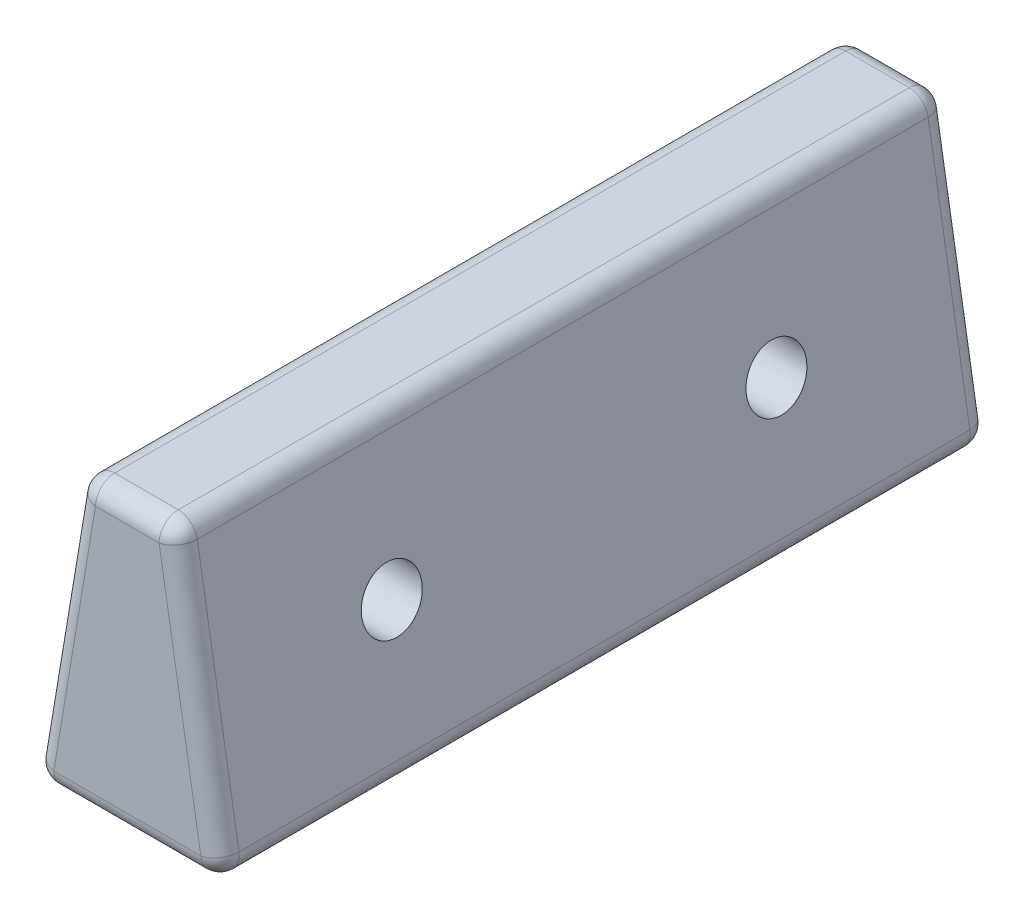
ISO-10303-21;
HEADER;
FILE_DESCRIPTION(('STEP AP214'),'2;1');
FILE_NAME('part.step','',(''),(''),'','','');
FILE_SCHEMA(('AUTOMOTIVE_DESIGN { 1 0 10303 214 1 1 1 1 }'));
ENDSEC;
DATA;
#1=APPLICATION_CONTEXT('core data for automotive mechanical design processes');
#2=APPLICATION_PROTOCOL_DEFINITION('international standard','automotive_design',2000,#1);
#3=PRODUCT_CONTEXT('',#1,'mechanical');
#4=PRODUCT('Part','Part','',(#3));
#5=PRODUCT_RELATED_PRODUCT_CATEGORY('part','',(#4));
#6=PRODUCT_DEFINITION_FORMATION('','',#4);
#7=PRODUCT_DEFINITION_CONTEXT('part definition',#1,'design');
#8=PRODUCT_DEFINITION('design','',#6,#7);
#9=PRODUCT_DEFINITION_SHAPE('','',#8);
#10=(LENGTH_UNIT() NAMED_UNIT(*) SI_UNIT(.MILLI.,.METRE.));
#11=(NAMED_UNIT(*) PLANE_ANGLE_UNIT() SI_UNIT($,.RADIAN.));
#12=(NAMED_UNIT(*) SI_UNIT($,.STERADIAN.) SOLID_ANGLE_UNIT());
#13=UNCERTAINTY_MEASURE_WITH_UNIT(LENGTH_MEASURE(1.E-05),#10,'distance_accuracy_value','');
#14=(GEOMETRIC_REPRESENTATION_CONTEXT(3) GLOBAL_UNCERTAINTY_ASSIGNED_CONTEXT((#13)) GLOBAL_UNIT_ASSIGNED_CONTEXT((#10,
#11,#12)) REPRESENTATION_CONTEXT('',''));
#15=CARTESIAN_POINT('',(0.,0.,0.));
#16=DIRECTION('',(0.,0.,1.));
#17=DIRECTION('',(1.,0.,0.));
#18=AXIS2_PLACEMENT_3D('',#15,#16,#17);
#19=CARTESIAN_POINT('',(6.34999999999986,38.1,50.8));
#20=DIRECTION('',(0.,-1.,0.));
#21=DIRECTION('',(1.,0.,0.));
#22=AXIS2_PLACEMENT_3D('',#19,#20,#21);
#23=PLANE('',#22);
#24=DIRECTION('',(-1.,0.,0.));
#25=VECTOR('',#24,1.);
#26=CARTESIAN_POINT('',(6.34999999999986,38.1,-48.26));
#27=LINE('',#26,#25);
#28=CARTESIAN_POINT('',(4.19829719550695,38.1,-48.26));
#29=VERTEX_POINT('',#28);
#30=CARTESIAN_POINT('',(-4.19829719550722,38.1,-48.26));
#31=VERTEX_POINT('',#30);
#32=EDGE_CURVE('E42',#29,#31,#27,.T.);
#33=ORIENTED_EDGE('',*,*,#32,.T.);
#34=DIRECTION('',(0.,0.,-1.));
#35=VECTOR('',#34,1.);
#36=CARTESIAN_POINT('',(-4.19829719550722,38.1,50.8));
#37=LINE('',#36,#35);
#38=CARTESIAN_POINT('',(-4.19829719550722,38.1,48.26));
#39=VERTEX_POINT('',#38);
#40=EDGE_CURVE('E11',#31,#39,#37,.F.);
#41=ORIENTED_EDGE('',*,*,#40,.T.);
#42=DIRECTION('',(-1.,0.,0.));
#43=VECTOR('',#42,1.);
#44=CARTESIAN_POINT('',(6.34999999999986,38.1,48.26));
#45=LINE('',#44,#43);
#46=CARTESIAN_POINT('',(4.19829719550695,38.1,48.26));
#47=VERTEX_POINT('',#46);
#48=EDGE_CURVE('E205',#39,#47,#45,.F.);
#49=ORIENTED_EDGE('',*,*,#48,.T.);
#50=DIRECTION('',(0.,0.,-1.));
#51=VECTOR('',#50,1.);
#52=CARTESIAN_POINT('',(4.19829719550695,38.1,50.8));
#53=LINE('',#52,#51);
#54=EDGE_CURVE('E203',#47,#29,#53,.T.);
#55=ORIENTED_EDGE('',*,*,#54,.T.);
#56=EDGE_LOOP('',(#33,#41,#49,#55));
#57=FACE_BOUND('',#56,.T.);
#58=ADVANCED_FACE('F33',(#57),#23,.F.);
#59=CARTESIAN_POINT('',(-6.35000000000014,38.1,50.8));
#60=DIRECTION('',(0.986393923832144,-0.164398987305354,0.));
#61=DIRECTION('',(0.164398987305354,0.986393923832144,0.));
#62=AXIS2_PLACEMENT_3D('',#59,#60,#61);
#63=PLANE('',#62);
#64=CARTESIAN_POINT('',(-9.52500000000007,19.05,25.4));
#65=DIRECTION('',(0.986393923832144,-0.164398987305354,0.));
#66=DIRECTION('',(0.164398987305354,0.986393923832144,0.));
#67=AXIS2_PLACEMENT_3D('',#64,#65,#66);
#68=ELLIPSE('',#67,4.0234939653535,3.96875);
#69=CARTESIAN_POINT('',(-8.86354166666675,23.01875,25.4));
#70=VERTEX_POINT('',#69);
#71=EDGE_CURVE('E162',#70,#70,#68,.T.);
#72=ORIENTED_EDGE('',*,*,#71,.T.);
#73=EDGE_LOOP('',(#72));
#74=FACE_BOUND('',#73,.T.);
#75=CARTESIAN_POINT('',(-9.52500000000007,19.05,-25.4));
#76=DIRECTION('',(0.986393923832144,-0.164398987305354,0.));
#77=DIRECTION('',(0.164398987305354,0.986393923832144,0.));
#78=AXIS2_PLACEMENT_3D('',#75,#76,#77);
#79=ELLIPSE('',#78,4.02349396535351,3.96875);
#80=CARTESIAN_POINT('',(-8.86354166666675,23.01875,-25.4));
#81=VERTEX_POINT('',#80);
#82=EDGE_CURVE('E257',#81,#81,#79,.T.);
#83=ORIENTED_EDGE('',*,*,#82,.T.);
#84=EDGE_LOOP('',(#83));
#85=FACE_BOUND('',#84,.T.);
#86=DIRECTION('',(0.,0.,-1.));
#87=VECTOR('',#86,1.);
#88=CARTESIAN_POINT('',(-6.70373776204087,35.9775734277556,50.8));
#89=LINE('',#88,#87);
#90=CARTESIAN_POINT('',(-6.70373776204087,35.9775734277556,48.26));
#91=VERTEX_POINT('',#90);
#92=CARTESIAN_POINT('',(-6.70373776204087,35.9775734277556,-48.26));
#93=VERTEX_POINT('',#92);
#94=EDGE_CURVE('E129',#91,#93,#89,.T.);
#95=ORIENTED_EDGE('',*,*,#94,.T.);
#96=DIRECTION('',(-0.164398987305354,-0.986393923832144,0.));
#97=VECTOR('',#96,1.);
#98=CARTESIAN_POINT('',(-6.35000000000014,38.1,-48.26));
#99=LINE('',#98,#97);
#100=CARTESIAN_POINT('',(-12.2070710953741,2.9575734277556,-48.26));
#101=VERTEX_POINT('',#100);
#102=EDGE_CURVE('E166',#93,#101,#99,.T.);
#103=ORIENTED_EDGE('',*,*,#102,.T.);
#104=DIRECTION('',(0.,0.,-1.));
#105=VECTOR('',#104,1.);
#106=CARTESIAN_POINT('',(-12.2070710953741,2.9575734277556,50.8));
#107=LINE('',#106,#105);
#108=CARTESIAN_POINT('',(-12.2070710953741,2.9575734277556,48.26));
#109=VERTEX_POINT('',#108);
#110=EDGE_CURVE('E131',#101,#109,#107,.F.);
#111=ORIENTED_EDGE('',*,*,#110,.T.);
#112=DIRECTION('',(-0.164398987305354,-0.986393923832144,0.));
#113=VECTOR('',#112,1.);
#114=CARTESIAN_POINT('',(-6.35000000000014,38.1,48.26));
#115=LINE('',#114,#113);
#116=EDGE_CURVE('E124',#109,#91,#115,.F.);
#117=ORIENTED_EDGE('',*,*,#116,.T.);
#118=EDGE_LOOP('',(#95,#103,#111,#117));
#119=FACE_BOUND('',#118,.T.);
#120=ADVANCED_FACE('F126',(#74,#85,#119),#63,.F.);
#121=CARTESIAN_POINT('',(-12.7,0.,50.8));
#122=DIRECTION('',(0.,1.,0.));
#123=DIRECTION('',(-1.,0.,0.));
#124=AXIS2_PLACEMENT_3D('',#121,#122,#123);
#125=PLANE('',#124);
#126=DIRECTION('',(0.,0.,-1.));
#127=VECTOR('',#126,1.);
#128=CARTESIAN_POINT('',(-9.70163052884043,0.,50.8));
#129=LINE('',#128,#127);
#130=CARTESIAN_POINT('',(-9.70163052884043,0.,48.26));
#131=VERTEX_POINT('',#130);
#132=CARTESIAN_POINT('',(-9.70163052884043,0.,-48.26));
#133=VERTEX_POINT('',#132);
#134=EDGE_CURVE('E181',#131,#133,#129,.T.);
#135=ORIENTED_EDGE('',*,*,#134,.T.);
#136=DIRECTION('',(1.,0.,0.));
#137=VECTOR('',#136,1.);
#138=CARTESIAN_POINT('',(-12.7,0.,-48.26));
#139=LINE('',#138,#137);
#140=CARTESIAN_POINT('',(9.70163052884041,0.,-48.26));
#141=VERTEX_POINT('',#140);
#142=EDGE_CURVE('E183',#133,#141,#139,.T.);
#143=ORIENTED_EDGE('',*,*,#142,.T.);
#144=DIRECTION('',(0.,0.,-1.));
#145=VECTOR('',#144,1.);
#146=CARTESIAN_POINT('',(9.70163052884041,0.,50.8));
#147=LINE('',#146,#145);
#148=CARTESIAN_POINT('',(9.70163052884041,0.,48.26));
#149=VERTEX_POINT('',#148);
#150=EDGE_CURVE('E177',#141,#149,#147,.F.);
#151=ORIENTED_EDGE('',*,*,#150,.T.);
#152=DIRECTION('',(1.,0.,0.));
#153=VECTOR('',#152,1.);
#154=CARTESIAN_POINT('',(-12.7,0.,48.26));
#155=LINE('',#154,#153);
#156=EDGE_CURVE('E179',#149,#131,#155,.F.);
#157=ORIENTED_EDGE('',*,*,#156,.T.);
#158=EDGE_LOOP('',(#135,#143,#151,#157));
#159=FACE_BOUND('',#158,.T.);
#160=ADVANCED_FACE('F286',(#159),#125,.F.);
#161=CARTESIAN_POINT('',(12.7,0.,50.8));
#162=DIRECTION('',(-0.986393923832143,-0.164398987305361,0.));
#163=DIRECTION('',(0.164398987305361,-0.986393923832143,0.));
#164=AXIS2_PLACEMENT_3D('',#161,#162,#163);
#165=PLANE('',#164);
#166=CARTESIAN_POINT('',(9.52499999999993,19.05,25.4));
#167=DIRECTION('',(-0.986393923832143,-0.164398987305361,0.));
#168=DIRECTION('',(0.164398987305361,-0.986393923832143,0.));
#169=AXIS2_PLACEMENT_3D('',#166,#167,#168);
#170=ELLIPSE('',#169,4.02349396535351,3.96875);
#171=CARTESIAN_POINT('',(10.1864583333333,15.08125,25.4));
#172=VERTEX_POINT('',#171);
#173=EDGE_CURVE('E37',#172,#172,#170,.T.);
#174=ORIENTED_EDGE('',*,*,#173,.T.);
#175=EDGE_LOOP('',(#174));
#176=FACE_BOUND('',#175,.T.);
#177=CARTESIAN_POINT('',(9.52499999999993,19.05,-25.4));
#178=DIRECTION('',(-0.986393923832143,-0.164398987305361,0.));
#179=DIRECTION('',(0.164398987305361,-0.986393923832143,0.));
#180=AXIS2_PLACEMENT_3D('',#177,#178,#179);
#181=ELLIPSE('',#180,4.02349396535351,3.96875);
#182=CARTESIAN_POINT('',(10.1864583333333,15.08125,-25.4));
#183=VERTEX_POINT('',#182);
#184=EDGE_CURVE('E255',#183,#183,#181,.T.);
#185=ORIENTED_EDGE('',*,*,#184,.T.);
#186=EDGE_LOOP('',(#185));
#187=FACE_BOUND('',#186,.T.);
#188=DIRECTION('',(0.,0.,-1.));
#189=VECTOR('',#188,1.);
#190=CARTESIAN_POINT('',(12.2070710953741,2.95757342775562,50.8));
#191=LINE('',#190,#189);
#192=CARTESIAN_POINT('',(12.2070710953741,2.95757342775562,48.26));
#193=VERTEX_POINT('',#192);
#194=CARTESIAN_POINT('',(12.2070710953741,2.95757342775562,-48.26));
#195=VERTEX_POINT('',#194);
#196=EDGE_CURVE('E198',#193,#195,#191,.T.);
#197=ORIENTED_EDGE('',*,*,#196,.T.);
#198=DIRECTION('',(-0.164398987305361,0.986393923832143,0.));
#199=VECTOR('',#198,1.);
#200=CARTESIAN_POINT('',(12.7,0.,-48.26));
#201=LINE('',#200,#199);
#202=CARTESIAN_POINT('',(6.7037377620406,35.9775734277556,-48.26));
#203=VERTEX_POINT('',#202);
#204=EDGE_CURVE('E200',#195,#203,#201,.T.);
#205=ORIENTED_EDGE('',*,*,#204,.T.);
#206=DIRECTION('',(0.,0.,-1.));
#207=VECTOR('',#206,1.);
#208=CARTESIAN_POINT('',(6.7037377620406,35.9775734277556,50.8));
#209=LINE('',#208,#207);
#210=CARTESIAN_POINT('',(6.7037377620406,35.9775734277556,48.26));
#211=VERTEX_POINT('',#210);
#212=EDGE_CURVE('E194',#203,#211,#209,.F.);
#213=ORIENTED_EDGE('',*,*,#212,.T.);
#214=DIRECTION('',(-0.164398987305361,0.986393923832143,0.));
#215=VECTOR('',#214,1.);
#216=CARTESIAN_POINT('',(12.7,0.,48.26));
#217=LINE('',#216,#215);
#218=EDGE_CURVE('E196',#211,#193,#217,.F.);
#219=ORIENTED_EDGE('',*,*,#218,.T.);
#220=EDGE_LOOP('',(#197,#205,#213,#219));
#221=FACE_BOUND('',#220,.T.);
#222=ADVANCED_FACE('F374',(#176,#187,#221),#165,.F.);
#223=CARTESIAN_POINT('',(0.,0.,50.8));
#224=DIRECTION('',(0.,0.,1.));
#225=DIRECTION('',(1.,0.,0.));
#226=AXIS2_PLACEMENT_3D('',#223,#224,#225);
#227=PLANE('',#226);
#228=DIRECTION('',(-1.,0.,0.));
#229=VECTOR('',#228,1.);
#230=CARTESIAN_POINT('',(-6.35000000000014,35.56,50.8));
#231=LINE('',#230,#229);
#232=CARTESIAN_POINT('',(4.19829719550695,35.56,50.8));
#233=VERTEX_POINT('',#232);
#234=CARTESIAN_POINT('',(-4.19829719550722,35.56,50.8));
#235=VERTEX_POINT('',#234);
#236=EDGE_CURVE('E188',#233,#235,#231,.T.);
#237=ORIENTED_EDGE('',*,*,#236,.T.);
#238=DIRECTION('',(-0.164398987305354,-0.986393923832144,0.));
#239=VECTOR('',#238,1.);
#240=CARTESIAN_POINT('',(-10.1945594334664,-0.417573427755599,50.8));
#241=LINE('',#240,#239);
#242=CARTESIAN_POINT('',(-9.70163052884043,2.54,50.8));
#243=VERTEX_POINT('',#242);
#244=EDGE_CURVE('E141',#235,#243,#241,.T.);
#245=ORIENTED_EDGE('',*,*,#244,.T.);
#246=DIRECTION('',(1.,0.,0.));
#247=VECTOR('',#246,1.);
#248=CARTESIAN_POINT('',(12.7,2.54,50.8));
#249=LINE('',#248,#247);
#250=CARTESIAN_POINT('',(9.70163052884041,2.54,50.8));
#251=VERTEX_POINT('',#250);
#252=EDGE_CURVE('E190',#243,#251,#249,.T.);
#253=ORIENTED_EDGE('',*,*,#252,.T.);
#254=DIRECTION('',(-0.164398987305361,0.986393923832143,0.));
#255=VECTOR('',#254,1.);
#256=CARTESIAN_POINT('',(3.84455943346621,37.6824265722444,50.8));
#257=LINE('',#256,#255);
#258=EDGE_CURVE('E186',#251,#233,#257,.T.);
#259=ORIENTED_EDGE('',*,*,#258,.T.);
#260=EDGE_LOOP('',(#237,#245,#253,#259));
#261=FACE_BOUND('',#260,.T.);
#262=ADVANCED_FACE('F367',(#261),#227,.T.);
#263=CARTESIAN_POINT('',(0.,0.,-50.8));
#264=DIRECTION('',(0.,0.,1.));
#265=DIRECTION('',(1.,0.,0.));
#266=AXIS2_PLACEMENT_3D('',#263,#264,#265);
#267=PLANE('',#266);
#268=DIRECTION('',(1.,0.,0.));
#269=VECTOR('',#268,1.);
#270=CARTESIAN_POINT('',(0.,2.54,-50.8));
#271=LINE('',#270,#269);
#272=CARTESIAN_POINT('',(9.70163052884041,2.54,-50.8));
#273=VERTEX_POINT('',#272);
#274=CARTESIAN_POINT('',(-9.70163052884043,2.54,-50.8));
#275=VERTEX_POINT('',#274);
#276=EDGE_CURVE('E172',#273,#275,#271,.F.);
#277=ORIENTED_EDGE('',*,*,#276,.T.);
#278=DIRECTION('',(-0.164398987305354,-0.986393923832144,0.));
#279=VECTOR('',#278,1.);
#280=CARTESIAN_POINT('',(-9.85131619022312,1.64188603170382,-50.8));
#281=LINE('',#280,#279);
#282=CARTESIAN_POINT('',(-4.19829719550722,35.56,-50.8));
#283=VERTEX_POINT('',#282);
#284=EDGE_CURVE('E174',#275,#283,#281,.F.);
#285=ORIENTED_EDGE('',*,*,#284,.T.);
#286=DIRECTION('',(-1.,0.,0.));
#287=VECTOR('',#286,1.);
#288=CARTESIAN_POINT('',(0.,35.56,-50.8));
#289=LINE('',#288,#287);
#290=CARTESIAN_POINT('',(4.19829719550695,35.56,-50.8));
#291=VERTEX_POINT('',#290);
#292=EDGE_CURVE('E168',#283,#291,#289,.F.);
#293=ORIENTED_EDGE('',*,*,#292,.T.);
#294=DIRECTION('',(-0.164398987305361,0.986393923832143,0.));
#295=VECTOR('',#294,1.);
#296=CARTESIAN_POINT('',(9.8513161902231,1.64188603170389,-50.8));
#297=LINE('',#296,#295);
#298=EDGE_CURVE('E170',#291,#273,#297,.F.);
#299=ORIENTED_EDGE('',*,*,#298,.T.);
#300=EDGE_LOOP('',(#277,#285,#293,#299));
#301=FACE_BOUND('',#300,.T.);
#302=ADVANCED_FACE('F359',(#301),#267,.F.);
#303=CARTESIAN_POINT('',(9.8513161902231,1.64188603170389,48.26));
#304=DIRECTION('',(0.164398987305361,-0.986393923832143,0.));
#305=DIRECTION('',(0.986393923832143,0.164398987305361,0.));
#306=AXIS2_PLACEMENT_3D('',#303,#304,#305);
#307=CYLINDRICAL_SURFACE('',#306,2.54);
#308=CARTESIAN_POINT('',(4.19829719550695,35.56,48.26));
#309=DIRECTION('',(-0.164398987305362,0.986393923832143,0.));
#310=DIRECTION('',(-0.986393923832143,-0.164398987305362,0.));
#311=AXIS2_PLACEMENT_3D('',#308,#309,#310);
#312=CIRCLE('',#311,2.54);
#313=EDGE_CURVE('E156',#233,#211,#312,.T.);
#314=ORIENTED_EDGE('',*,*,#313,.F.);
#315=ORIENTED_EDGE('',*,*,#258,.F.);
#316=CARTESIAN_POINT('',(9.70163052884041,2.54,48.26));
#317=DIRECTION('',(0.164398987305361,-0.986393923832143,0.));
#318=DIRECTION('',(0.986393923832143,0.164398987305361,0.));
#319=AXIS2_PLACEMENT_3D('',#316,#317,#318);
#320=CIRCLE('',#319,2.54);
#321=EDGE_CURVE('E159',#193,#251,#320,.T.);
#322=ORIENTED_EDGE('',*,*,#321,.F.);
#323=ORIENTED_EDGE('',*,*,#218,.F.);
#324=EDGE_LOOP('',(#314,#315,#322,#323));
#325=FACE_BOUND('',#324,.T.);
#326=ADVANCED_FACE('F35',(#325),#307,.T.);
#327=CARTESIAN_POINT('',(4.19829719550695,35.56,48.26));
#328=DIRECTION('',(0.,0.,1.));
#329=DIRECTION('',(1.,0.,0.));
#330=AXIS2_PLACEMENT_3D('',#327,#328,#329);
#331=SPHERICAL_SURFACE('',#330,2.54);
#332=CARTESIAN_POINT('',(4.19829719550695,35.56,48.26));
#333=DIRECTION('',(1.,0.,0.));
#334=DIRECTION('',(0.,1.,0.));
#335=AXIS2_PLACEMENT_3D('',#332,#333,#334);
#336=CIRCLE('',#335,2.54);
#337=EDGE_CURVE('E248',#233,#47,#336,.F.);
#338=ORIENTED_EDGE('',*,*,#337,.F.);
#339=ORIENTED_EDGE('',*,*,#313,.T.);
#340=CARTESIAN_POINT('',(4.19829719550695,35.56,48.26));
#341=DIRECTION('',(0.,0.,1.));
#342=DIRECTION('',(1.,0.,0.));
#343=AXIS2_PLACEMENT_3D('',#340,#341,#342);
#344=CIRCLE('',#343,2.54);
#345=EDGE_CURVE('E251',#47,#211,#344,.F.);
#346=ORIENTED_EDGE('',*,*,#345,.F.);
#347=EDGE_LOOP('',(#338,#339,#346));
#348=FACE_BOUND('',#347,.T.);
#349=ADVANCED_FACE('F352',(#348),#331,.T.);
#350=CARTESIAN_POINT('',(9.70163052884041,2.54,48.26));
#351=DIRECTION('',(0.,0.,1.));
#352=DIRECTION('',(1.,0.,0.));
#353=AXIS2_PLACEMENT_3D('',#350,#351,#352);
#354=SPHERICAL_SURFACE('',#353,2.54);
#355=CARTESIAN_POINT('',(9.70163052884041,2.54,48.26));
#356=DIRECTION('',(0.,0.,1.));
#357=DIRECTION('',(1.,0.,0.));
#358=AXIS2_PLACEMENT_3D('',#355,#356,#357);
#359=CIRCLE('',#358,2.54);
#360=EDGE_CURVE('E243',#193,#149,#359,.F.);
#361=ORIENTED_EDGE('',*,*,#360,.F.);
#362=ORIENTED_EDGE('',*,*,#321,.T.);
#363=CARTESIAN_POINT('',(9.70163052884041,2.54,48.26));
#364=DIRECTION('',(1.,0.,0.));
#365=DIRECTION('',(0.,1.,0.));
#366=AXIS2_PLACEMENT_3D('',#363,#364,#365);
#367=CIRCLE('',#366,2.54);
#368=EDGE_CURVE('E246',#149,#251,#367,.F.);
#369=ORIENTED_EDGE('',*,*,#368,.F.);
#370=EDGE_LOOP('',(#361,#362,#369));
#371=FACE_BOUND('',#370,.T.);
#372=ADVANCED_FACE('F349',(#371),#354,.T.);
#373=CARTESIAN_POINT('',(4.19829719550695,35.56,50.8));
#374=DIRECTION('',(0.,0.,-1.));
#375=DIRECTION('',(-1.,0.,0.));
#376=AXIS2_PLACEMENT_3D('',#373,#374,#375);
#377=CYLINDRICAL_SURFACE('',#376,2.54);
#378=ORIENTED_EDGE('',*,*,#345,.T.);
#379=ORIENTED_EDGE('',*,*,#212,.F.);
#380=CARTESIAN_POINT('',(4.19829719550695,35.56,-48.26));
#381=DIRECTION('',(0.,0.,-1.));
#382=DIRECTION('',(-1.,0.,0.));
#383=AXIS2_PLACEMENT_3D('',#380,#381,#382);
#384=CIRCLE('',#383,2.54);
#385=EDGE_CURVE('E238',#29,#203,#384,.T.);
#386=ORIENTED_EDGE('',*,*,#385,.F.);
#387=ORIENTED_EDGE('',*,*,#54,.F.);
#388=EDGE_LOOP('',(#378,#379,#386,#387));
#389=FACE_BOUND('',#388,.T.);
#390=ADVANCED_FACE('F345',(#389),#377,.T.);
#391=CARTESIAN_POINT('',(0.,35.56,48.26));
#392=DIRECTION('',(1.,0.,0.));
#393=DIRECTION('',(0.,1.,0.));
#394=AXIS2_PLACEMENT_3D('',#391,#392,#393);
#395=CYLINDRICAL_SURFACE('',#394,2.54);
#396=ORIENTED_EDGE('',*,*,#337,.T.);
#397=ORIENTED_EDGE('',*,*,#48,.F.);
#398=CARTESIAN_POINT('',(-4.19829719550722,35.56,48.26));
#399=DIRECTION('',(-1.,0.,0.));
#400=DIRECTION('',(0.,0.,1.));
#401=AXIS2_PLACEMENT_3D('',#398,#399,#400);
#402=CIRCLE('',#401,2.54);
#403=EDGE_CURVE('E145',#235,#39,#402,.T.);
#404=ORIENTED_EDGE('',*,*,#403,.F.);
#405=ORIENTED_EDGE('',*,*,#236,.F.);
#406=EDGE_LOOP('',(#396,#397,#404,#405));
#407=FACE_BOUND('',#406,.T.);
#408=ADVANCED_FACE('F342',(#407),#395,.T.);
#409=CARTESIAN_POINT('',(-9.85131619022313,1.64188603170382,48.26));
#410=DIRECTION('',(0.164398987305354,0.986393923832144,0.));
#411=DIRECTION('',(-0.986393923832144,0.164398987305354,0.));
#412=AXIS2_PLACEMENT_3D('',#409,#410,#411);
#413=CYLINDRICAL_SURFACE('',#412,2.54);
#414=CARTESIAN_POINT('',(-9.70163052884043,2.54,48.26));
#415=DIRECTION('',(-0.164398987305354,-0.986393923832144,0.));
#416=DIRECTION('',(0.986393923832144,-0.164398987305354,0.));
#417=AXIS2_PLACEMENT_3D('',#414,#415,#416);
#418=CIRCLE('',#417,2.54);
#419=EDGE_CURVE('E146',#243,#109,#418,.T.);
#420=ORIENTED_EDGE('',*,*,#419,.F.);
#421=ORIENTED_EDGE('',*,*,#244,.F.);
#422=CARTESIAN_POINT('',(-4.19829719550722,35.56,48.26));
#423=DIRECTION('',(0.164398987305354,0.986393923832144,0.));
#424=DIRECTION('',(-0.986393923832144,0.164398987305354,0.));
#425=AXIS2_PLACEMENT_3D('',#422,#423,#424);
#426=CIRCLE('',#425,2.54);
#427=EDGE_CURVE('E138',#91,#235,#426,.T.);
#428=ORIENTED_EDGE('',*,*,#427,.F.);
#429=ORIENTED_EDGE('',*,*,#116,.F.);
#430=EDGE_LOOP('',(#420,#421,#428,#429));
#431=FACE_BOUND('',#430,.T.);
#432=ADVANCED_FACE('F140',(#431),#413,.T.);
#433=CARTESIAN_POINT('',(0.,2.54,48.26));
#434=DIRECTION('',(-1.,0.,0.));
#435=DIRECTION('',(0.,-1.,0.));
#436=AXIS2_PLACEMENT_3D('',#433,#434,#435);
#437=CYLINDRICAL_SURFACE('',#436,2.54);
#438=ORIENTED_EDGE('',*,*,#368,.T.);
#439=ORIENTED_EDGE('',*,*,#252,.F.);
#440=CARTESIAN_POINT('',(-9.70163052884043,2.54,48.26));
#441=DIRECTION('',(-1.,0.,0.));
#442=DIRECTION('',(0.,0.,1.));
#443=AXIS2_PLACEMENT_3D('',#440,#441,#442);
#444=CIRCLE('',#443,2.54);
#445=EDGE_CURVE('E233',#131,#243,#444,.T.);
#446=ORIENTED_EDGE('',*,*,#445,.F.);
#447=ORIENTED_EDGE('',*,*,#156,.F.);
#448=EDGE_LOOP('',(#438,#439,#446,#447));
#449=FACE_BOUND('',#448,.T.);
#450=ADVANCED_FACE('F335',(#449),#437,.T.);
#451=CARTESIAN_POINT('',(9.70163052884041,2.54,50.8));
#452=DIRECTION('',(0.,0.,-1.));
#453=DIRECTION('',(-1.,0.,0.));
#454=AXIS2_PLACEMENT_3D('',#451,#452,#453);
#455=CYLINDRICAL_SURFACE('',#454,2.54);
#456=ORIENTED_EDGE('',*,*,#360,.T.);
#457=ORIENTED_EDGE('',*,*,#150,.F.);
#458=CARTESIAN_POINT('',(9.70163052884041,2.54,-48.26));
#459=DIRECTION('',(0.,0.,-1.));
#460=DIRECTION('',(-1.,0.,0.));
#461=AXIS2_PLACEMENT_3D('',#458,#459,#460);
#462=CIRCLE('',#461,2.54);
#463=EDGE_CURVE('E230',#195,#141,#462,.T.);
#464=ORIENTED_EDGE('',*,*,#463,.F.);
#465=ORIENTED_EDGE('',*,*,#196,.F.);
#466=EDGE_LOOP('',(#456,#457,#464,#465));
#467=FACE_BOUND('',#466,.T.);
#468=ADVANCED_FACE('F331',(#467),#455,.T.);
#469=CARTESIAN_POINT('',(10.1945594334664,-0.417573427755612,-48.26));
#470=DIRECTION('',(-0.164398987305361,0.986393923832143,0.));
#471=DIRECTION('',(-0.986393923832143,-0.164398987305361,0.));
#472=AXIS2_PLACEMENT_3D('',#469,#470,#471);
#473=CYLINDRICAL_SURFACE('',#472,2.54);
#474=CARTESIAN_POINT('',(4.19829719550695,35.56,-48.26));
#475=DIRECTION('',(-0.164398987305362,0.986393923832143,0.));
#476=DIRECTION('',(-0.986393923832143,-0.164398987305362,0.));
#477=AXIS2_PLACEMENT_3D('',#474,#475,#476);
#478=CIRCLE('',#477,2.54);
#479=EDGE_CURVE('E240',#203,#291,#478,.T.);
#480=ORIENTED_EDGE('',*,*,#479,.F.);
#481=ORIENTED_EDGE('',*,*,#204,.F.);
#482=CARTESIAN_POINT('',(9.70163052884041,2.54,-48.26));
#483=DIRECTION('',(0.164398987305361,-0.986393923832143,0.));
#484=DIRECTION('',(0.986393923832143,0.164398987305361,0.));
#485=AXIS2_PLACEMENT_3D('',#482,#483,#484);
#486=CIRCLE('',#485,2.54);
#487=EDGE_CURVE('E227',#273,#195,#486,.T.);
#488=ORIENTED_EDGE('',*,*,#487,.F.);
#489=ORIENTED_EDGE('',*,*,#298,.F.);
#490=EDGE_LOOP('',(#480,#481,#488,#489));
#491=FACE_BOUND('',#490,.T.);
#492=ADVANCED_FACE('F327',(#491),#473,.T.);
#493=CARTESIAN_POINT('',(4.19829719550695,35.56,-48.26));
#494=DIRECTION('',(0.,0.,1.));
#495=DIRECTION('',(1.,0.,0.));
#496=AXIS2_PLACEMENT_3D('',#493,#494,#495);
#497=SPHERICAL_SURFACE('',#496,2.54);
#498=ORIENTED_EDGE('',*,*,#385,.T.);
#499=ORIENTED_EDGE('',*,*,#479,.T.);
#500=CARTESIAN_POINT('',(4.19829719550695,35.56,-48.26));
#501=DIRECTION('',(1.,0.,0.));
#502=DIRECTION('',(0.,1.,0.));
#503=AXIS2_PLACEMENT_3D('',#500,#501,#502);
#504=CIRCLE('',#503,2.54);
#505=EDGE_CURVE('E152',#29,#291,#504,.F.);
#506=ORIENTED_EDGE('',*,*,#505,.F.);
#507=EDGE_LOOP('',(#498,#499,#506));
#508=FACE_BOUND('',#507,.T.);
#509=ADVANCED_FACE('F324',(#508),#497,.T.);
#510=CARTESIAN_POINT('',(-4.19829719550722,35.56,48.26));
#511=DIRECTION('',(0.,0.,1.));
#512=DIRECTION('',(1.,0.,0.));
#513=AXIS2_PLACEMENT_3D('',#510,#511,#512);
#514=SPHERICAL_SURFACE('',#513,2.54);
#515=ORIENTED_EDGE('',*,*,#427,.T.);
#516=ORIENTED_EDGE('',*,*,#403,.T.);
#517=CARTESIAN_POINT('',(-4.19829719550722,35.56,48.26));
#518=DIRECTION('',(0.,0.,1.));
#519=DIRECTION('',(1.,0.,0.));
#520=AXIS2_PLACEMENT_3D('',#517,#518,#519);
#521=CIRCLE('',#520,2.54);
#522=EDGE_CURVE('E149',#91,#39,#521,.F.);
#523=ORIENTED_EDGE('',*,*,#522,.F.);
#524=EDGE_LOOP('',(#515,#516,#523));
#525=FACE_BOUND('',#524,.T.);
#526=ADVANCED_FACE('F150',(#525),#514,.T.);
#527=CARTESIAN_POINT('',(-9.70163052884043,2.54,48.26));
#528=DIRECTION('',(0.,0.,1.));
#529=DIRECTION('',(1.,0.,0.));
#530=AXIS2_PLACEMENT_3D('',#527,#528,#529);
#531=SPHERICAL_SURFACE('',#530,2.54);
#532=ORIENTED_EDGE('',*,*,#445,.T.);
#533=ORIENTED_EDGE('',*,*,#419,.T.);
#534=CARTESIAN_POINT('',(-9.70163052884043,2.54,48.26));
#535=DIRECTION('',(0.,0.,1.));
#536=DIRECTION('',(1.,0.,0.));
#537=AXIS2_PLACEMENT_3D('',#534,#535,#536);
#538=CIRCLE('',#537,2.54);
#539=EDGE_CURVE('E153',#131,#109,#538,.F.);
#540=ORIENTED_EDGE('',*,*,#539,.F.);
#541=EDGE_LOOP('',(#532,#533,#540));
#542=FACE_BOUND('',#541,.T.);
#543=ADVANCED_FACE('F317',(#542),#531,.T.);
#544=CARTESIAN_POINT('',(9.70163052884041,2.54,-48.26));
#545=DIRECTION('',(0.,0.,1.));
#546=DIRECTION('',(1.,0.,0.));
#547=AXIS2_PLACEMENT_3D('',#544,#545,#546);
#548=SPHERICAL_SURFACE('',#547,2.54);
#549=ORIENTED_EDGE('',*,*,#487,.T.);
#550=ORIENTED_EDGE('',*,*,#463,.T.);
#551=CARTESIAN_POINT('',(9.70163052884041,2.54,-48.26));
#552=DIRECTION('',(1.,0.,0.));
#553=DIRECTION('',(0.,0.,-1.));
#554=AXIS2_PLACEMENT_3D('',#551,#552,#553);
#555=CIRCLE('',#554,2.54);
#556=EDGE_CURVE('E221',#273,#141,#555,.F.);
#557=ORIENTED_EDGE('',*,*,#556,.F.);
#558=EDGE_LOOP('',(#549,#550,#557));
#559=FACE_BOUND('',#558,.T.);
#560=ADVANCED_FACE('F313',(#559),#548,.T.);
#561=CARTESIAN_POINT('',(6.34999999999986,35.56,-48.26));
#562=DIRECTION('',(-1.,0.,0.));
#563=DIRECTION('',(0.,-1.,0.));
#564=AXIS2_PLACEMENT_3D('',#561,#562,#563);
#565=CYLINDRICAL_SURFACE('',#564,2.54);
#566=ORIENTED_EDGE('',*,*,#505,.T.);
#567=ORIENTED_EDGE('',*,*,#292,.F.);
#568=CARTESIAN_POINT('',(-4.19829719550722,35.56,-48.26));
#569=DIRECTION('',(-1.,0.,0.));
#570=DIRECTION('',(0.,-1.,0.));
#571=AXIS2_PLACEMENT_3D('',#568,#569,#570);
#572=CIRCLE('',#571,2.54);
#573=EDGE_CURVE('E219',#31,#283,#572,.T.);
#574=ORIENTED_EDGE('',*,*,#573,.F.);
#575=ORIENTED_EDGE('',*,*,#32,.F.);
#576=EDGE_LOOP('',(#566,#567,#574,#575));
#577=FACE_BOUND('',#576,.T.);
#578=ADVANCED_FACE('F310',(#577),#565,.T.);
#579=CARTESIAN_POINT('',(-4.19829719550722,35.56,50.8));
#580=DIRECTION('',(0.,0.,-1.));
#581=DIRECTION('',(-1.,0.,0.));
#582=AXIS2_PLACEMENT_3D('',#579,#580,#581);
#583=CYLINDRICAL_SURFACE('',#582,2.54);
#584=ORIENTED_EDGE('',*,*,#522,.T.);
#585=ORIENTED_EDGE('',*,*,#40,.F.);
#586=CARTESIAN_POINT('',(-4.19829719550722,35.56,-48.26));
#587=DIRECTION('',(0.,0.,-1.));
#588=DIRECTION('',(-1.,0.,0.));
#589=AXIS2_PLACEMENT_3D('',#586,#587,#588);
#590=CIRCLE('',#589,2.54);
#591=EDGE_CURVE('E50',#93,#31,#590,.T.);
#592=ORIENTED_EDGE('',*,*,#591,.F.);
#593=ORIENTED_EDGE('',*,*,#94,.F.);
#594=EDGE_LOOP('',(#584,#585,#592,#593));
#595=FACE_BOUND('',#594,.T.);
#596=ADVANCED_FACE('F155',(#595),#583,.T.);
#597=CARTESIAN_POINT('',(-9.70163052884043,2.54,50.8));
#598=DIRECTION('',(0.,0.,-1.));
#599=DIRECTION('',(-1.,0.,0.));
#600=AXIS2_PLACEMENT_3D('',#597,#598,#599);
#601=CYLINDRICAL_SURFACE('',#600,2.54);
#602=ORIENTED_EDGE('',*,*,#539,.T.);
#603=ORIENTED_EDGE('',*,*,#110,.F.);
#604=CARTESIAN_POINT('',(-9.70163052884043,2.54,-48.26));
#605=DIRECTION('',(0.,0.,-1.));
#606=DIRECTION('',(-1.,0.,0.));
#607=AXIS2_PLACEMENT_3D('',#604,#605,#606);
#608=CIRCLE('',#607,2.54);
#609=EDGE_CURVE('E215',#133,#101,#608,.T.);
#610=ORIENTED_EDGE('',*,*,#609,.F.);
#611=ORIENTED_EDGE('',*,*,#134,.F.);
#612=EDGE_LOOP('',(#602,#603,#610,#611));
#613=FACE_BOUND('',#612,.T.);
#614=ADVANCED_FACE('F303',(#613),#601,.T.);
#615=CARTESIAN_POINT('',(-12.7,2.54,-48.26));
#616=DIRECTION('',(1.,0.,0.));
#617=DIRECTION('',(0.,1.,0.));
#618=AXIS2_PLACEMENT_3D('',#615,#616,#617);
#619=CYLINDRICAL_SURFACE('',#618,2.54);
#620=ORIENTED_EDGE('',*,*,#556,.T.);
#621=ORIENTED_EDGE('',*,*,#142,.F.);
#622=CARTESIAN_POINT('',(-9.70163052884043,2.54,-48.26));
#623=DIRECTION('',(-1.,0.,0.));
#624=DIRECTION('',(0.,-1.,0.));
#625=AXIS2_PLACEMENT_3D('',#622,#623,#624);
#626=CIRCLE('',#625,2.54);
#627=EDGE_CURVE('E212',#275,#133,#626,.T.);
#628=ORIENTED_EDGE('',*,*,#627,.F.);
#629=ORIENTED_EDGE('',*,*,#276,.F.);
#630=EDGE_LOOP('',(#620,#621,#628,#629));
#631=FACE_BOUND('',#630,.T.);
#632=ADVANCED_FACE('F300',(#631),#619,.T.);
#633=CARTESIAN_POINT('',(-4.19829719550722,35.56,-48.26));
#634=DIRECTION('',(0.,0.,1.));
#635=DIRECTION('',(1.,0.,0.));
#636=AXIS2_PLACEMENT_3D('',#633,#634,#635);
#637=SPHERICAL_SURFACE('',#636,2.54);
#638=ORIENTED_EDGE('',*,*,#591,.T.);
#639=ORIENTED_EDGE('',*,*,#573,.T.);
#640=CARTESIAN_POINT('',(-4.19829719550722,35.56,-48.26));
#641=DIRECTION('',(0.164398987305354,0.986393923832144,0.));
#642=DIRECTION('',(-0.986393923832144,0.164398987305354,0.));
#643=AXIS2_PLACEMENT_3D('',#640,#641,#642);
#644=CIRCLE('',#643,2.54);
#645=EDGE_CURVE('E210',#93,#283,#644,.F.);
#646=ORIENTED_EDGE('',*,*,#645,.F.);
#647=EDGE_LOOP('',(#638,#639,#646));
#648=FACE_BOUND('',#647,.T.);
#649=ADVANCED_FACE('F296',(#648),#637,.T.);
#650=CARTESIAN_POINT('',(-9.70163052884043,2.54,-48.26));
#651=DIRECTION('',(0.,0.,1.));
#652=DIRECTION('',(1.,0.,0.));
#653=AXIS2_PLACEMENT_3D('',#650,#651,#652);
#654=SPHERICAL_SURFACE('',#653,2.54);
#655=ORIENTED_EDGE('',*,*,#627,.T.);
#656=ORIENTED_EDGE('',*,*,#609,.T.);
#657=CARTESIAN_POINT('',(-9.70163052884043,2.54,-48.26));
#658=DIRECTION('',(-0.164398987305354,-0.986393923832144,0.));
#659=DIRECTION('',(0.986393923832144,-0.164398987305354,0.));
#660=AXIS2_PLACEMENT_3D('',#657,#658,#659);
#661=CIRCLE('',#660,2.54);
#662=EDGE_CURVE('E208',#275,#101,#661,.F.);
#663=ORIENTED_EDGE('',*,*,#662,.F.);
#664=EDGE_LOOP('',(#655,#656,#663));
#665=FACE_BOUND('',#664,.T.);
#666=ADVANCED_FACE('F292',(#665),#654,.T.);
#667=CARTESIAN_POINT('',(-3.8445594334665,37.6824265722444,-48.26));
#668=DIRECTION('',(-0.164398987305354,-0.986393923832144,0.));
#669=DIRECTION('',(0.986393923832144,-0.164398987305354,0.));
#670=AXIS2_PLACEMENT_3D('',#667,#668,#669);
#671=CYLINDRICAL_SURFACE('',#670,2.54);
#672=ORIENTED_EDGE('',*,*,#645,.T.);
#673=ORIENTED_EDGE('',*,*,#284,.F.);
#674=ORIENTED_EDGE('',*,*,#662,.T.);
#675=ORIENTED_EDGE('',*,*,#102,.F.);
#676=EDGE_LOOP('',(#672,#673,#674,#675));
#677=FACE_BOUND('',#676,.T.);
#678=ADVANCED_FACE('F278',(#677),#671,.T.);
#679=CARTESIAN_POINT('',(-12.2416305288404,19.05,-25.4));
#680=DIRECTION('',(1.,0.,0.));
#681=DIRECTION('',(0.,0.,-1.));
#682=AXIS2_PLACEMENT_3D('',#679,#680,#681);
#683=CYLINDRICAL_SURFACE('',#682,3.96875);
#684=ORIENTED_EDGE('',*,*,#184,.F.);
#685=EDGE_LOOP('',(#684));
#686=FACE_BOUND('',#685,.T.);
#687=ORIENTED_EDGE('',*,*,#82,.F.);
#688=EDGE_LOOP('',(#687));
#689=FACE_BOUND('',#688,.T.);
#690=ADVANCED_FACE('F272',(#686,#689),#683,.F.);
#691=CARTESIAN_POINT('',(-12.2416305288404,19.05,25.4));
#692=DIRECTION('',(1.,0.,0.));
#693=DIRECTION('',(0.,0.,-1.));
#694=AXIS2_PLACEMENT_3D('',#691,#692,#693);
#695=CYLINDRICAL_SURFACE('',#694,3.96875);
#696=ORIENTED_EDGE('',*,*,#173,.F.);
#697=EDGE_LOOP('',(#696));
#698=FACE_BOUND('',#697,.T.);
#699=ORIENTED_EDGE('',*,*,#71,.F.);
#700=EDGE_LOOP('',(#699));
#701=FACE_BOUND('',#700,.T.);
#702=ADVANCED_FACE('F270',(#698,#701),#695,.F.);
#703=CLOSED_SHELL('',(#58,#120,#160,#222,#262,#302,#326,#349,#372,#390,#408,#432,#450,#468,#492,
#509,#526,#543,#560,#578,#596,#614,#632,#649,#666,#678,#690,#702));
#704=MANIFOLD_SOLID_BREP('B2',#703);
#705=ADVANCED_BREP_SHAPE_REPRESENTATION('',(#18,#704),#14);
#706=SHAPE_DEFINITION_REPRESENTATION(#9,#705);
ENDSEC;
END-ISO-10303-21;
